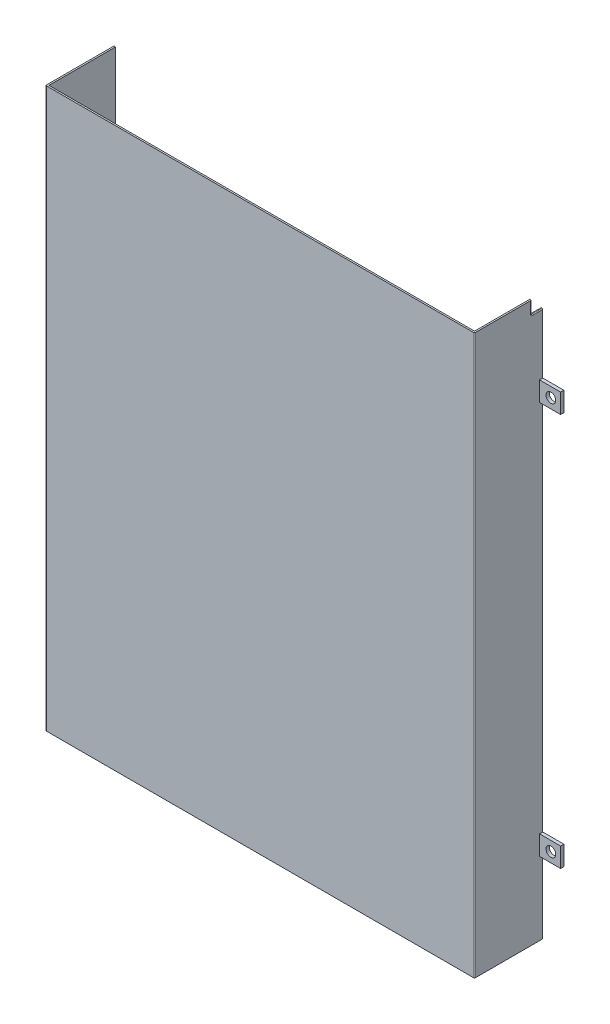
ISO-10303-21;
HEADER;
FILE_DESCRIPTION(('STEP AP214'),'2;1');
FILE_NAME('part.step','',(''),(''),'','','');
FILE_SCHEMA(('AUTOMOTIVE_DESIGN { 1 0 10303 214 1 1 1 1 }'));
ENDSEC;
DATA;
#1=APPLICATION_CONTEXT('core data for automotive mechanical design processes');
#2=APPLICATION_PROTOCOL_DEFINITION('international standard','automotive_design',2000,#1);
#3=PRODUCT_CONTEXT('',#1,'mechanical');
#4=PRODUCT('Part','Part','',(#3));
#5=PRODUCT_RELATED_PRODUCT_CATEGORY('part','',(#4));
#6=PRODUCT_DEFINITION_FORMATION('','',#4);
#7=PRODUCT_DEFINITION_CONTEXT('part definition',#1,'design');
#8=PRODUCT_DEFINITION('design','',#6,#7);
#9=PRODUCT_DEFINITION_SHAPE('','',#8);
#10=(LENGTH_UNIT() NAMED_UNIT(*) SI_UNIT(.MILLI.,.METRE.));
#11=(NAMED_UNIT(*) PLANE_ANGLE_UNIT() SI_UNIT($,.RADIAN.));
#12=(NAMED_UNIT(*) SI_UNIT($,.STERADIAN.) SOLID_ANGLE_UNIT());
#13=UNCERTAINTY_MEASURE_WITH_UNIT(LENGTH_MEASURE(1.E-05),#10,'distance_accuracy_value','');
#14=(GEOMETRIC_REPRESENTATION_CONTEXT(3) GLOBAL_UNCERTAINTY_ASSIGNED_CONTEXT((#13)) GLOBAL_UNIT_ASSIGNED_CONTEXT((#10,
#11,#12)) REPRESENTATION_CONTEXT('',''));
#15=CARTESIAN_POINT('',(0.,0.,0.));
#16=DIRECTION('',(0.,0.,1.));
#17=DIRECTION('',(1.,0.,0.));
#18=AXIS2_PLACEMENT_3D('',#15,#16,#17);
#19=CARTESIAN_POINT('',(212.,-172.,111.));
#20=DIRECTION('',(-1.,0.,0.));
#21=DIRECTION('',(0.,0.,1.));
#22=AXIS2_PLACEMENT_3D('',#19,#20,#21);
#23=PLANE('',#22);
#24=CARTESIAN_POINT('',(212.,164.5,117.5));
#25=DIRECTION('',(-1.,0.,0.));
#26=DIRECTION('',(0.,0.,1.));
#27=AXIS2_PLACEMENT_3D('',#24,#25,#26);
#28=CIRCLE('',#27,1.);
#29=CARTESIAN_POINT('',(212.,163.5,117.5));
#30=VERTEX_POINT('',#29);
#31=CARTESIAN_POINT('',(212.,164.5,118.5));
#32=VERTEX_POINT('',#31);
#33=EDGE_CURVE('E358',#30,#32,#28,.T.);
#34=ORIENTED_EDGE('',*,*,#33,.T.);
#35=DIRECTION('',(0.,1.,0.));
#36=VECTOR('',#35,1.);
#37=CARTESIAN_POINT('',(212.,172.,118.5));
#38=LINE('',#37,#36);
#39=CARTESIAN_POINT('',(212.,172.,118.5));
#40=VERTEX_POINT('',#39);
#41=EDGE_CURVE('E361',#32,#40,#38,.T.);
#42=ORIENTED_EDGE('',*,*,#41,.T.);
#43=DIRECTION('',(0.,0.,-1.));
#44=VECTOR('',#43,1.);
#45=CARTESIAN_POINT('',(212.,172.,111.));
#46=LINE('',#45,#44);
#47=CARTESIAN_POINT('',(212.,172.,152.5));
#48=VERTEX_POINT('',#47);
#49=EDGE_CURVE('E285',#40,#48,#46,.F.);
#50=ORIENTED_EDGE('',*,*,#49,.T.);
#51=DIRECTION('',(0.,1.,0.));
#52=VECTOR('',#51,1.);
#53=CARTESIAN_POINT('',(212.,-172.,152.5));
#54=LINE('',#53,#52);
#55=CARTESIAN_POINT('',(212.,-172.,152.5));
#56=VERTEX_POINT('',#55);
#57=EDGE_CURVE('E348',#48,#56,#54,.F.);
#58=ORIENTED_EDGE('',*,*,#57,.T.);
#59=DIRECTION('',(0.,0.,-1.));
#60=VECTOR('',#59,1.);
#61=CARTESIAN_POINT('',(212.,-172.,111.));
#62=LINE('',#61,#60);
#63=CARTESIAN_POINT('',(212.,-172.,111.));
#64=VERTEX_POINT('',#63);
#65=EDGE_CURVE('E302',#64,#56,#62,.F.);
#66=ORIENTED_EDGE('',*,*,#65,.F.);
#67=DIRECTION('',(0.,1.,0.));
#68=VECTOR('',#67,1.);
#69=CARTESIAN_POINT('',(212.,-172.,111.));
#70=LINE('',#69,#68);
#71=CARTESIAN_POINT('',(212.,-127.,111.));
#72=VERTEX_POINT('',#71);
#73=EDGE_CURVE('E323',#64,#72,#70,.T.);
#74=ORIENTED_EDGE('',*,*,#73,.T.);
#75=DIRECTION('',(0.,0.,-1.));
#76=VECTOR('',#75,1.);
#77=CARTESIAN_POINT('',(212.,-127.,113.));
#78=LINE('',#77,#76);
#79=CARTESIAN_POINT('',(212.,-127.,113.));
#80=VERTEX_POINT('',#79);
#81=EDGE_CURVE('E266',#80,#72,#78,.T.);
#82=ORIENTED_EDGE('',*,*,#81,.F.);
#83=DIRECTION('',(0.,1.,0.));
#84=VECTOR('',#83,1.);
#85=CARTESIAN_POINT('',(212.,-127.,113.));
#86=LINE('',#85,#84);
#87=CARTESIAN_POINT('',(212.,-115.,113.));
#88=VERTEX_POINT('',#87);
#89=EDGE_CURVE('E245',#80,#88,#86,.T.);
#90=ORIENTED_EDGE('',*,*,#89,.T.);
#91=DIRECTION('',(0.,0.,-1.));
#92=VECTOR('',#91,1.);
#93=CARTESIAN_POINT('',(212.,-115.,113.));
#94=LINE('',#93,#92);
#95=CARTESIAN_POINT('',(212.,-115.,111.));
#96=VERTEX_POINT('',#95);
#97=EDGE_CURVE('E258',#88,#96,#94,.T.);
#98=ORIENTED_EDGE('',*,*,#97,.T.);
#99=CARTESIAN_POINT('',(212.,115.,111.));
#100=VERTEX_POINT('',#99);
#101=EDGE_CURVE('E326',#96,#100,#70,.T.);
#102=ORIENTED_EDGE('',*,*,#101,.T.);
#103=DIRECTION('',(0.,0.,-1.));
#104=VECTOR('',#103,1.);
#105=CARTESIAN_POINT('',(212.,115.,113.));
#106=LINE('',#105,#104);
#107=CARTESIAN_POINT('',(212.,115.,113.));
#108=VERTEX_POINT('',#107);
#109=EDGE_CURVE('E233',#108,#100,#106,.T.);
#110=ORIENTED_EDGE('',*,*,#109,.F.);
#111=DIRECTION('',(0.,1.,0.));
#112=VECTOR('',#111,1.);
#113=CARTESIAN_POINT('',(212.,115.,113.));
#114=LINE('',#113,#112);
#115=CARTESIAN_POINT('',(212.,127.,113.));
#116=VERTEX_POINT('',#115);
#117=EDGE_CURVE('E220',#108,#116,#114,.T.);
#118=ORIENTED_EDGE('',*,*,#117,.T.);
#119=DIRECTION('',(0.,0.,-1.));
#120=VECTOR('',#119,1.);
#121=CARTESIAN_POINT('',(212.,127.,113.));
#122=LINE('',#121,#120);
#123=CARTESIAN_POINT('',(212.,127.,111.));
#124=VERTEX_POINT('',#123);
#125=EDGE_CURVE('E207',#116,#124,#122,.T.);
#126=ORIENTED_EDGE('',*,*,#125,.T.);
#127=CARTESIAN_POINT('',(212.,163.5,111.));
#128=VERTEX_POINT('',#127);
#129=EDGE_CURVE('E327',#124,#128,#70,.T.);
#130=ORIENTED_EDGE('',*,*,#129,.T.);
#131=DIRECTION('',(0.,0.,1.));
#132=VECTOR('',#131,1.);
#133=CARTESIAN_POINT('',(212.,163.5,117.5));
#134=LINE('',#133,#132);
#135=EDGE_CURVE('E356',#128,#30,#134,.T.);
#136=ORIENTED_EDGE('',*,*,#135,.T.);
#137=EDGE_LOOP('',(#34,#42,#50,#58,#66,#74,#82,#90,#98,#102,#110,#118,#126,#130,#136));
#138=FACE_BOUND('',#137,.T.);
#139=ADVANCED_FACE('F38',(#138),#23,.F.);
#140=CARTESIAN_POINT('',(211.,-172.,111.));
#141=DIRECTION('',(-1.,0.,0.));
#142=DIRECTION('',(0.,0.,1.));
#143=AXIS2_PLACEMENT_3D('',#140,#141,#142);
#144=PLANE('',#143);
#145=DIRECTION('',(0.,-1.,0.));
#146=VECTOR('',#145,1.);
#147=CARTESIAN_POINT('',(211.,-172.,118.));
#148=LINE('',#147,#146);
#149=CARTESIAN_POINT('',(211.,172.,118.));
#150=VERTEX_POINT('',#149);
#151=CARTESIAN_POINT('',(211.,164.5,118.));
#152=VERTEX_POINT('',#151);
#153=EDGE_CURVE('E380',#150,#152,#148,.T.);
#154=ORIENTED_EDGE('',*,*,#153,.T.);
#155=CARTESIAN_POINT('',(211.,164.5,117.5));
#156=DIRECTION('',(-1.,0.,0.));
#157=DIRECTION('',(0.,0.,1.));
#158=AXIS2_PLACEMENT_3D('',#155,#156,#157);
#159=CIRCLE('',#158,0.5);
#160=CARTESIAN_POINT('',(211.,164.,117.5));
#161=VERTEX_POINT('',#160);
#162=EDGE_CURVE('E354',#152,#161,#159,.F.);
#163=ORIENTED_EDGE('',*,*,#162,.T.);
#164=DIRECTION('',(0.,0.,-1.));
#165=VECTOR('',#164,1.);
#166=CARTESIAN_POINT('',(211.,164.,111.));
#167=LINE('',#166,#165);
#168=CARTESIAN_POINT('',(211.,164.,111.));
#169=VERTEX_POINT('',#168);
#170=EDGE_CURVE('E385',#161,#169,#167,.T.);
#171=ORIENTED_EDGE('',*,*,#170,.T.);
#172=DIRECTION('',(0.,1.,0.));
#173=VECTOR('',#172,1.);
#174=CARTESIAN_POINT('',(211.,-172.,111.));
#175=LINE('',#174,#173);
#176=CARTESIAN_POINT('',(211.,-172.,111.));
#177=VERTEX_POINT('',#176);
#178=EDGE_CURVE('E320',#177,#169,#175,.T.);
#179=ORIENTED_EDGE('',*,*,#178,.F.);
#180=DIRECTION('',(0.,0.,1.));
#181=VECTOR('',#180,1.);
#182=CARTESIAN_POINT('',(211.,-172.,111.));
#183=LINE('',#182,#181);
#184=CARTESIAN_POINT('',(211.,-172.,152.));
#185=VERTEX_POINT('',#184);
#186=EDGE_CURVE('E307',#177,#185,#183,.T.);
#187=ORIENTED_EDGE('',*,*,#186,.T.);
#188=DIRECTION('',(0.,1.,0.));
#189=VECTOR('',#188,1.);
#190=CARTESIAN_POINT('',(211.,-172.,152.));
#191=LINE('',#190,#189);
#192=CARTESIAN_POINT('',(211.,172.,152.));
#193=VERTEX_POINT('',#192);
#194=EDGE_CURVE('E317',#185,#193,#191,.T.);
#195=ORIENTED_EDGE('',*,*,#194,.T.);
#196=DIRECTION('',(0.,0.,1.));
#197=VECTOR('',#196,1.);
#198=CARTESIAN_POINT('',(211.,172.,111.));
#199=LINE('',#198,#197);
#200=EDGE_CURVE('E287',#150,#193,#199,.T.);
#201=ORIENTED_EDGE('',*,*,#200,.F.);
#202=EDGE_LOOP('',(#154,#163,#171,#179,#187,#195,#201));
#203=FACE_BOUND('',#202,.T.);
#204=ADVANCED_FACE('F399',(#203),#144,.T.);
#205=CARTESIAN_POINT('',(211.,-172.,111.));
#206=DIRECTION('',(0.,0.,1.));
#207=DIRECTION('',(1.,0.,0.));
#208=AXIS2_PLACEMENT_3D('',#205,#206,#207);
#209=PLANE('',#208);
#210=CARTESIAN_POINT('',(219.,121.,111.));
#211=DIRECTION('',(0.,0.,-1.));
#212=DIRECTION('',(-1.,0.,0.));
#213=AXIS2_PLACEMENT_3D('',#210,#211,#212);
#214=CIRCLE('',#213,2.99999999999999);
#215=CARTESIAN_POINT('',(216.,121.,111.));
#216=VERTEX_POINT('',#215);
#217=EDGE_CURVE('E388',#216,#216,#214,.T.);
#218=ORIENTED_EDGE('',*,*,#217,.F.);
#219=EDGE_LOOP('',(#218));
#220=FACE_BOUND('',#219,.T.);
#221=CARTESIAN_POINT('',(219.,-121.,111.));
#222=DIRECTION('',(0.,0.,-1.));
#223=DIRECTION('',(-1.,0.,0.));
#224=AXIS2_PLACEMENT_3D('',#221,#222,#223);
#225=CIRCLE('',#224,2.99999999999999);
#226=CARTESIAN_POINT('',(216.,-121.,111.));
#227=VERTEX_POINT('',#226);
#228=EDGE_CURVE('E236',#227,#227,#225,.T.);
#229=ORIENTED_EDGE('',*,*,#228,.F.);
#230=EDGE_LOOP('',(#229));
#231=FACE_BOUND('',#230,.T.);
#232=DIRECTION('',(-1.,0.,0.));
#233=VECTOR('',#232,1.);
#234=CARTESIAN_POINT('',(766.567680720757,164.,111.));
#235=LINE('',#234,#233);
#236=CARTESIAN_POINT('',(211.5,164.,111.));
#237=VERTEX_POINT('',#236);
#238=EDGE_CURVE('E377',#237,#169,#235,.T.);
#239=ORIENTED_EDGE('',*,*,#238,.F.);
#240=CARTESIAN_POINT('',(211.5,163.5,111.));
#241=DIRECTION('',(0.,0.,1.));
#242=DIRECTION('',(1.,0.,0.));
#243=AXIS2_PLACEMENT_3D('',#240,#241,#242);
#244=CIRCLE('',#243,0.5);
#245=EDGE_CURVE('E11',#237,#128,#244,.F.);
#246=ORIENTED_EDGE('',*,*,#245,.T.);
#247=ORIENTED_EDGE('',*,*,#129,.F.);
#248=DIRECTION('',(1.,0.,0.));
#249=VECTOR('',#248,1.);
#250=CARTESIAN_POINT('',(212.,127.,111.));
#251=LINE('',#250,#249);
#252=CARTESIAN_POINT('',(225.,127.,111.));
#253=VERTEX_POINT('',#252);
#254=EDGE_CURVE('E227',#124,#253,#251,.T.);
#255=ORIENTED_EDGE('',*,*,#254,.T.);
#256=DIRECTION('',(0.,-1.,0.));
#257=VECTOR('',#256,1.);
#258=CARTESIAN_POINT('',(225.,115.,111.));
#259=LINE('',#258,#257);
#260=CARTESIAN_POINT('',(225.,115.,111.));
#261=VERTEX_POINT('',#260);
#262=EDGE_CURVE('E201',#253,#261,#259,.T.);
#263=ORIENTED_EDGE('',*,*,#262,.T.);
#264=DIRECTION('',(-1.,0.,0.));
#265=VECTOR('',#264,1.);
#266=CARTESIAN_POINT('',(212.,115.,111.));
#267=LINE('',#266,#265);
#268=EDGE_CURVE('E222',#261,#100,#267,.T.);
#269=ORIENTED_EDGE('',*,*,#268,.T.);
#270=ORIENTED_EDGE('',*,*,#101,.F.);
#271=DIRECTION('',(1.,0.,0.));
#272=VECTOR('',#271,1.);
#273=CARTESIAN_POINT('',(212.,-115.,111.));
#274=LINE('',#273,#272);
#275=CARTESIAN_POINT('',(225.,-115.,111.));
#276=VERTEX_POINT('',#275);
#277=EDGE_CURVE('E242',#96,#276,#274,.T.);
#278=ORIENTED_EDGE('',*,*,#277,.T.);
#279=DIRECTION('',(0.,-1.,0.));
#280=VECTOR('',#279,1.);
#281=CARTESIAN_POINT('',(225.,-127.,111.));
#282=LINE('',#281,#280);
#283=CARTESIAN_POINT('',(225.,-127.,111.));
#284=VERTEX_POINT('',#283);
#285=EDGE_CURVE('E261',#276,#284,#282,.T.);
#286=ORIENTED_EDGE('',*,*,#285,.T.);
#287=DIRECTION('',(-1.,0.,0.));
#288=VECTOR('',#287,1.);
#289=CARTESIAN_POINT('',(212.,-127.,111.));
#290=LINE('',#289,#288);
#291=EDGE_CURVE('E249',#284,#72,#290,.T.);
#292=ORIENTED_EDGE('',*,*,#291,.T.);
#293=ORIENTED_EDGE('',*,*,#73,.F.);
#294=DIRECTION('',(1.,0.,0.));
#295=VECTOR('',#294,1.);
#296=CARTESIAN_POINT('',(211.,-172.,111.));
#297=LINE('',#296,#295);
#298=EDGE_CURVE('E305',#177,#64,#297,.T.);
#299=ORIENTED_EDGE('',*,*,#298,.F.);
#300=ORIENTED_EDGE('',*,*,#178,.T.);
#301=EDGE_LOOP('',(#239,#246,#247,#255,#263,#269,#270,#278,#286,#292,#293,#299,#300));
#302=FACE_BOUND('',#301,.T.);
#303=ADVANCED_FACE('F395',(#220,#231,#302),#209,.F.);
#304=CARTESIAN_POINT('',(0.,172.,0.));
#305=DIRECTION('',(0.,-1.,0.));
#306=DIRECTION('',(-1.,0.,0.));
#307=AXIS2_PLACEMENT_3D('',#304,#305,#306);
#308=PLANE('',#307);
#309=ORIENTED_EDGE('',*,*,#49,.F.);
#310=CARTESIAN_POINT('',(211.5,172.,118.5));
#311=DIRECTION('',(0.,-1.,0.));
#312=DIRECTION('',(0.,0.,-1.));
#313=AXIS2_PLACEMENT_3D('',#310,#311,#312);
#314=CIRCLE('',#313,0.5);
#315=CARTESIAN_POINT('',(211.5,172.,118.));
#316=VERTEX_POINT('',#315);
#317=EDGE_CURVE('E62',#40,#316,#314,.F.);
#318=ORIENTED_EDGE('',*,*,#317,.T.);
#319=DIRECTION('',(-1.,0.,0.));
#320=VECTOR('',#319,1.);
#321=CARTESIAN_POINT('',(766.567680720757,172.,118.));
#322=LINE('',#321,#320);
#323=EDGE_CURVE('E375',#316,#150,#322,.T.);
#324=ORIENTED_EDGE('',*,*,#323,.T.);
#325=ORIENTED_EDGE('',*,*,#200,.T.);
#326=DIRECTION('',(-1.,0.,0.));
#327=VECTOR('',#326,1.);
#328=CARTESIAN_POINT('',(211.,172.,152.));
#329=LINE('',#328,#327);
#330=CARTESIAN_POINT('',(-51.,172.,152.));
#331=VERTEX_POINT('',#330);
#332=EDGE_CURVE('E289',#193,#331,#329,.T.);
#333=ORIENTED_EDGE('',*,*,#332,.T.);
#334=DIRECTION('',(0.,0.,-1.));
#335=VECTOR('',#334,1.);
#336=CARTESIAN_POINT('',(-51.,172.,152.));
#337=LINE('',#336,#335);
#338=CARTESIAN_POINT('',(-51.,172.,111.));
#339=VERTEX_POINT('',#338);
#340=EDGE_CURVE('E268',#331,#339,#337,.T.);
#341=ORIENTED_EDGE('',*,*,#340,.T.);
#342=DIRECTION('',(1.,0.,0.));
#343=VECTOR('',#342,1.);
#344=CARTESIAN_POINT('',(-52.,172.,111.));
#345=LINE('',#344,#343);
#346=CARTESIAN_POINT('',(-52.,172.,111.));
#347=VERTEX_POINT('',#346);
#348=EDGE_CURVE('E277',#347,#339,#345,.T.);
#349=ORIENTED_EDGE('',*,*,#348,.F.);
#350=DIRECTION('',(0.,0.,-1.));
#351=VECTOR('',#350,1.);
#352=CARTESIAN_POINT('',(-52.,172.,152.));
#353=LINE('',#352,#351);
#354=CARTESIAN_POINT('',(-52.,172.,152.5));
#355=VERTEX_POINT('',#354);
#356=EDGE_CURVE('E280',#355,#347,#353,.T.);
#357=ORIENTED_EDGE('',*,*,#356,.F.);
#358=CARTESIAN_POINT('',(-51.5,172.,152.5));
#359=DIRECTION('',(0.,-1.,0.));
#360=DIRECTION('',(0.,0.,-1.));
#361=AXIS2_PLACEMENT_3D('',#358,#359,#360);
#362=CIRCLE('',#361,0.5);
#363=CARTESIAN_POINT('',(-51.5,172.,153.));
#364=VERTEX_POINT('',#363);
#365=EDGE_CURVE('E337',#355,#364,#362,.F.);
#366=ORIENTED_EDGE('',*,*,#365,.T.);
#367=DIRECTION('',(-1.,0.,0.));
#368=VECTOR('',#367,1.);
#369=CARTESIAN_POINT('',(211.,172.,153.));
#370=LINE('',#369,#368);
#371=CARTESIAN_POINT('',(211.5,172.,153.));
#372=VERTEX_POINT('',#371);
#373=EDGE_CURVE('E282',#372,#364,#370,.T.);
#374=ORIENTED_EDGE('',*,*,#373,.F.);
#375=CARTESIAN_POINT('',(211.5,172.,152.5));
#376=DIRECTION('',(0.,-1.,0.));
#377=DIRECTION('',(0.,0.,-1.));
#378=AXIS2_PLACEMENT_3D('',#375,#376,#377);
#379=CIRCLE('',#378,0.5);
#380=EDGE_CURVE('E334',#372,#48,#379,.F.);
#381=ORIENTED_EDGE('',*,*,#380,.T.);
#382=EDGE_LOOP('',(#309,#318,#324,#325,#333,#341,#349,#357,#366,#374,#381));
#383=FACE_BOUND('',#382,.T.);
#384=ADVANCED_FACE('F398',(#383),#308,.F.);
#385=CARTESIAN_POINT('',(-51.,-172.,152.));
#386=DIRECTION('',(1.,0.,0.));
#387=DIRECTION('',(0.,0.,-1.));
#388=AXIS2_PLACEMENT_3D('',#385,#386,#387);
#389=PLANE('',#388);
#390=DIRECTION('',(0.,1.,0.));
#391=VECTOR('',#390,1.);
#392=CARTESIAN_POINT('',(-51.,-172.,111.));
#393=LINE('',#392,#391);
#394=CARTESIAN_POINT('',(-51.,-172.,111.));
#395=VERTEX_POINT('',#394);
#396=EDGE_CURVE('E313',#395,#339,#393,.T.);
#397=ORIENTED_EDGE('',*,*,#396,.T.);
#398=ORIENTED_EDGE('',*,*,#340,.F.);
#399=DIRECTION('',(0.,1.,0.));
#400=VECTOR('',#399,1.);
#401=CARTESIAN_POINT('',(-51.,-172.,152.));
#402=LINE('',#401,#400);
#403=CARTESIAN_POINT('',(-51.,-172.,152.));
#404=VERTEX_POINT('',#403);
#405=EDGE_CURVE('E314',#404,#331,#402,.T.);
#406=ORIENTED_EDGE('',*,*,#405,.F.);
#407=DIRECTION('',(0.,0.,-1.));
#408=VECTOR('',#407,1.);
#409=CARTESIAN_POINT('',(-51.,-172.,152.));
#410=LINE('',#409,#408);
#411=EDGE_CURVE('E292',#404,#395,#410,.T.);
#412=ORIENTED_EDGE('',*,*,#411,.T.);
#413=EDGE_LOOP('',(#397,#398,#406,#412));
#414=FACE_BOUND('',#413,.T.);
#415=ADVANCED_FACE('F448',(#414),#389,.T.);
#416=CARTESIAN_POINT('',(211.,-172.,152.));
#417=DIRECTION('',(0.,0.,-1.));
#418=DIRECTION('',(-1.,0.,0.));
#419=AXIS2_PLACEMENT_3D('',#416,#417,#418);
#420=PLANE('',#419);
#421=ORIENTED_EDGE('',*,*,#405,.T.);
#422=ORIENTED_EDGE('',*,*,#332,.F.);
#423=ORIENTED_EDGE('',*,*,#194,.F.);
#424=DIRECTION('',(-1.,0.,0.));
#425=VECTOR('',#424,1.);
#426=CARTESIAN_POINT('',(211.,-172.,152.));
#427=LINE('',#426,#425);
#428=EDGE_CURVE('E310',#185,#404,#427,.T.);
#429=ORIENTED_EDGE('',*,*,#428,.T.);
#430=EDGE_LOOP('',(#421,#422,#423,#429));
#431=FACE_BOUND('',#430,.T.);
#432=ADVANCED_FACE('F438',(#431),#420,.T.);
#433=CARTESIAN_POINT('',(211.,-172.,153.));
#434=DIRECTION('',(0.,0.,-1.));
#435=DIRECTION('',(-1.,0.,0.));
#436=AXIS2_PLACEMENT_3D('',#433,#434,#435);
#437=PLANE('',#436);
#438=ORIENTED_EDGE('',*,*,#373,.T.);
#439=DIRECTION('',(0.,1.,0.));
#440=VECTOR('',#439,1.);
#441=CARTESIAN_POINT('',(-51.5,-172.,153.));
#442=LINE('',#441,#440);
#443=CARTESIAN_POINT('',(-51.5,-172.,153.));
#444=VERTEX_POINT('',#443);
#445=EDGE_CURVE('E342',#364,#444,#442,.F.);
#446=ORIENTED_EDGE('',*,*,#445,.T.);
#447=DIRECTION('',(-1.,0.,0.));
#448=VECTOR('',#447,1.);
#449=CARTESIAN_POINT('',(211.,-172.,153.));
#450=LINE('',#449,#448);
#451=CARTESIAN_POINT('',(211.5,-172.,153.));
#452=VERTEX_POINT('',#451);
#453=EDGE_CURVE('E299',#452,#444,#450,.T.);
#454=ORIENTED_EDGE('',*,*,#453,.F.);
#455=DIRECTION('',(0.,1.,0.));
#456=VECTOR('',#455,1.);
#457=CARTESIAN_POINT('',(211.5,-172.,153.));
#458=LINE('',#457,#456);
#459=EDGE_CURVE('E339',#452,#372,#458,.T.);
#460=ORIENTED_EDGE('',*,*,#459,.T.);
#461=EDGE_LOOP('',(#438,#446,#454,#460));
#462=FACE_BOUND('',#461,.T.);
#463=ADVANCED_FACE('F434',(#462),#437,.F.);
#464=CARTESIAN_POINT('',(-52.,-172.,152.));
#465=DIRECTION('',(1.,0.,0.));
#466=DIRECTION('',(0.,0.,-1.));
#467=AXIS2_PLACEMENT_3D('',#464,#465,#466);
#468=PLANE('',#467);
#469=DIRECTION('',(0.,0.,-1.));
#470=VECTOR('',#469,1.);
#471=CARTESIAN_POINT('',(-52.,-172.,152.));
#472=LINE('',#471,#470);
#473=CARTESIAN_POINT('',(-52.,-172.,152.5));
#474=VERTEX_POINT('',#473);
#475=CARTESIAN_POINT('',(-52.,-172.,111.));
#476=VERTEX_POINT('',#475);
#477=EDGE_CURVE('E297',#474,#476,#472,.T.);
#478=ORIENTED_EDGE('',*,*,#477,.F.);
#479=DIRECTION('',(0.,1.,0.));
#480=VECTOR('',#479,1.);
#481=CARTESIAN_POINT('',(-52.,-172.,152.5));
#482=LINE('',#481,#480);
#483=EDGE_CURVE('E316',#474,#355,#482,.T.);
#484=ORIENTED_EDGE('',*,*,#483,.T.);
#485=ORIENTED_EDGE('',*,*,#356,.T.);
#486=DIRECTION('',(0.,1.,0.));
#487=VECTOR('',#486,1.);
#488=CARTESIAN_POINT('',(-52.,-172.,111.));
#489=LINE('',#488,#487);
#490=EDGE_CURVE('E328',#476,#347,#489,.T.);
#491=ORIENTED_EDGE('',*,*,#490,.F.);
#492=EDGE_LOOP('',(#478,#484,#485,#491));
#493=FACE_BOUND('',#492,.T.);
#494=ADVANCED_FACE('F437',(#493),#468,.F.);
#495=CARTESIAN_POINT('',(-52.,-172.,111.));
#496=DIRECTION('',(0.,0.,1.));
#497=DIRECTION('',(1.,0.,0.));
#498=AXIS2_PLACEMENT_3D('',#495,#496,#497);
#499=PLANE('',#498);
#500=ORIENTED_EDGE('',*,*,#490,.T.);
#501=ORIENTED_EDGE('',*,*,#348,.T.);
#502=ORIENTED_EDGE('',*,*,#396,.F.);
#503=DIRECTION('',(1.,0.,0.));
#504=VECTOR('',#503,1.);
#505=CARTESIAN_POINT('',(-52.,-172.,111.));
#506=LINE('',#505,#504);
#507=EDGE_CURVE('E295',#476,#395,#506,.T.);
#508=ORIENTED_EDGE('',*,*,#507,.F.);
#509=EDGE_LOOP('',(#500,#501,#502,#508));
#510=FACE_BOUND('',#509,.T.);
#511=ADVANCED_FACE('F442',(#510),#499,.F.);
#512=CARTESIAN_POINT('',(0.,-172.,0.));
#513=DIRECTION('',(0.,-1.,0.));
#514=DIRECTION('',(-1.,0.,0.));
#515=AXIS2_PLACEMENT_3D('',#512,#513,#514);
#516=PLANE('',#515);
#517=ORIENTED_EDGE('',*,*,#453,.T.);
#518=CARTESIAN_POINT('',(-51.5,-172.,152.5));
#519=DIRECTION('',(0.,-1.,0.));
#520=DIRECTION('',(0.,0.,-1.));
#521=AXIS2_PLACEMENT_3D('',#518,#519,#520);
#522=CIRCLE('',#521,0.5);
#523=EDGE_CURVE('E346',#444,#474,#522,.T.);
#524=ORIENTED_EDGE('',*,*,#523,.T.);
#525=ORIENTED_EDGE('',*,*,#477,.T.);
#526=ORIENTED_EDGE('',*,*,#507,.T.);
#527=ORIENTED_EDGE('',*,*,#411,.F.);
#528=ORIENTED_EDGE('',*,*,#428,.F.);
#529=ORIENTED_EDGE('',*,*,#186,.F.);
#530=ORIENTED_EDGE('',*,*,#298,.T.);
#531=ORIENTED_EDGE('',*,*,#65,.T.);
#532=CARTESIAN_POINT('',(211.5,-172.,152.5));
#533=DIRECTION('',(0.,-1.,0.));
#534=DIRECTION('',(0.,0.,-1.));
#535=AXIS2_PLACEMENT_3D('',#532,#533,#534);
#536=CIRCLE('',#535,0.5);
#537=EDGE_CURVE('E344',#56,#452,#536,.T.);
#538=ORIENTED_EDGE('',*,*,#537,.T.);
#539=EDGE_LOOP('',(#517,#524,#525,#526,#527,#528,#529,#530,#531,#538));
#540=FACE_BOUND('',#539,.T.);
#541=ADVANCED_FACE('F446',(#540),#516,.T.);
#542=CARTESIAN_POINT('',(212.,-127.,113.));
#543=DIRECTION('',(0.,-1.,0.));
#544=DIRECTION('',(1.,0.,0.));
#545=AXIS2_PLACEMENT_3D('',#542,#543,#544);
#546=PLANE('',#545);
#547=ORIENTED_EDGE('',*,*,#291,.F.);
#548=DIRECTION('',(0.,0.,-1.));
#549=VECTOR('',#548,1.);
#550=CARTESIAN_POINT('',(225.,-127.,113.));
#551=LINE('',#550,#549);
#552=CARTESIAN_POINT('',(225.,-127.,113.));
#553=VERTEX_POINT('',#552);
#554=EDGE_CURVE('E269',#553,#284,#551,.T.);
#555=ORIENTED_EDGE('',*,*,#554,.F.);
#556=DIRECTION('',(-1.,0.,0.));
#557=VECTOR('',#556,1.);
#558=CARTESIAN_POINT('',(212.,-127.,113.));
#559=LINE('',#558,#557);
#560=EDGE_CURVE('E255',#553,#80,#559,.T.);
#561=ORIENTED_EDGE('',*,*,#560,.T.);
#562=ORIENTED_EDGE('',*,*,#81,.T.);
#563=EDGE_LOOP('',(#547,#555,#561,#562));
#564=FACE_BOUND('',#563,.T.);
#565=ADVANCED_FACE('F506',(#564),#546,.T.);
#566=CARTESIAN_POINT('',(225.,-127.,113.));
#567=DIRECTION('',(1.,0.,0.));
#568=DIRECTION('',(0.,0.,-1.));
#569=AXIS2_PLACEMENT_3D('',#566,#567,#568);
#570=PLANE('',#569);
#571=ORIENTED_EDGE('',*,*,#285,.F.);
#572=DIRECTION('',(0.,0.,-1.));
#573=VECTOR('',#572,1.);
#574=CARTESIAN_POINT('',(225.,-115.,113.));
#575=LINE('',#574,#573);
#576=CARTESIAN_POINT('',(225.,-115.,113.));
#577=VERTEX_POINT('',#576);
#578=EDGE_CURVE('E271',#577,#276,#575,.T.);
#579=ORIENTED_EDGE('',*,*,#578,.F.);
#580=DIRECTION('',(0.,-1.,0.));
#581=VECTOR('',#580,1.);
#582=CARTESIAN_POINT('',(225.,-127.,113.));
#583=LINE('',#582,#581);
#584=EDGE_CURVE('E252',#577,#553,#583,.T.);
#585=ORIENTED_EDGE('',*,*,#584,.T.);
#586=ORIENTED_EDGE('',*,*,#554,.T.);
#587=EDGE_LOOP('',(#571,#579,#585,#586));
#588=FACE_BOUND('',#587,.T.);
#589=ADVANCED_FACE('F514',(#588),#570,.T.);
#590=CARTESIAN_POINT('',(212.,-115.,113.));
#591=DIRECTION('',(0.,1.,0.));
#592=DIRECTION('',(0.,0.,1.));
#593=AXIS2_PLACEMENT_3D('',#590,#591,#592);
#594=PLANE('',#593);
#595=ORIENTED_EDGE('',*,*,#277,.F.);
#596=ORIENTED_EDGE('',*,*,#97,.F.);
#597=DIRECTION('',(1.,0.,0.));
#598=VECTOR('',#597,1.);
#599=CARTESIAN_POINT('',(212.,-115.,113.));
#600=LINE('',#599,#598);
#601=EDGE_CURVE('E248',#88,#577,#600,.T.);
#602=ORIENTED_EDGE('',*,*,#601,.T.);
#603=ORIENTED_EDGE('',*,*,#578,.T.);
#604=EDGE_LOOP('',(#595,#596,#602,#603));
#605=FACE_BOUND('',#604,.T.);
#606=ADVANCED_FACE('F512',(#605),#594,.T.);
#607=CARTESIAN_POINT('',(0.,0.,113.));
#608=DIRECTION('',(0.,0.,-1.));
#609=DIRECTION('',(-1.,0.,0.));
#610=AXIS2_PLACEMENT_3D('',#607,#608,#609);
#611=PLANE('',#610);
#612=CARTESIAN_POINT('',(219.,-121.,113.));
#613=DIRECTION('',(0.,0.,-1.));
#614=DIRECTION('',(-1.,0.,0.));
#615=AXIS2_PLACEMENT_3D('',#612,#613,#614);
#616=CIRCLE('',#615,2.99999999999999);
#617=CARTESIAN_POINT('',(216.,-121.,113.));
#618=VERTEX_POINT('',#617);
#619=EDGE_CURVE('E239',#618,#618,#616,.T.);
#620=ORIENTED_EDGE('',*,*,#619,.T.);
#621=EDGE_LOOP('',(#620));
#622=FACE_BOUND('',#621,.T.);
#623=ORIENTED_EDGE('',*,*,#89,.F.);
#624=ORIENTED_EDGE('',*,*,#560,.F.);
#625=ORIENTED_EDGE('',*,*,#584,.F.);
#626=ORIENTED_EDGE('',*,*,#601,.F.);
#627=EDGE_LOOP('',(#623,#624,#625,#626));
#628=FACE_BOUND('',#627,.T.);
#629=ADVANCED_FACE('F422',(#622,#628),#611,.F.);
#630=CARTESIAN_POINT('',(219.,-121.,113.));
#631=DIRECTION('',(0.,0.,-1.));
#632=DIRECTION('',(-1.,0.,0.));
#633=AXIS2_PLACEMENT_3D('',#630,#631,#632);
#634=CYLINDRICAL_SURFACE('',#633,2.99999999999999);
#635=ORIENTED_EDGE('',*,*,#619,.F.);
#636=EDGE_LOOP('',(#635));
#637=FACE_BOUND('',#636,.T.);
#638=ORIENTED_EDGE('',*,*,#228,.T.);
#639=EDGE_LOOP('',(#638));
#640=FACE_BOUND('',#639,.T.);
#641=ADVANCED_FACE('F415',(#637,#640),#634,.F.);
#642=CARTESIAN_POINT('',(212.,115.,113.));
#643=DIRECTION('',(0.,-1.,0.));
#644=DIRECTION('',(1.,0.,0.));
#645=AXIS2_PLACEMENT_3D('',#642,#643,#644);
#646=PLANE('',#645);
#647=ORIENTED_EDGE('',*,*,#268,.F.);
#648=DIRECTION('',(0.,0.,-1.));
#649=VECTOR('',#648,1.);
#650=CARTESIAN_POINT('',(225.,115.,113.));
#651=LINE('',#650,#649);
#652=CARTESIAN_POINT('',(225.,115.,113.));
#653=VERTEX_POINT('',#652);
#654=EDGE_CURVE('E206',#653,#261,#651,.T.);
#655=ORIENTED_EDGE('',*,*,#654,.F.);
#656=DIRECTION('',(-1.,0.,0.));
#657=VECTOR('',#656,1.);
#658=CARTESIAN_POINT('',(212.,115.,113.));
#659=LINE('',#658,#657);
#660=EDGE_CURVE('E215',#653,#108,#659,.T.);
#661=ORIENTED_EDGE('',*,*,#660,.T.);
#662=ORIENTED_EDGE('',*,*,#109,.T.);
#663=EDGE_LOOP('',(#647,#655,#661,#662));
#664=FACE_BOUND('',#663,.T.);
#665=ADVANCED_FACE('F413',(#664),#646,.T.);
#666=CARTESIAN_POINT('',(225.,115.,113.));
#667=DIRECTION('',(1.,0.,0.));
#668=DIRECTION('',(0.,0.,-1.));
#669=AXIS2_PLACEMENT_3D('',#666,#667,#668);
#670=PLANE('',#669);
#671=ORIENTED_EDGE('',*,*,#262,.F.);
#672=DIRECTION('',(0.,0.,-1.));
#673=VECTOR('',#672,1.);
#674=CARTESIAN_POINT('',(225.,127.,113.));
#675=LINE('',#674,#673);
#676=CARTESIAN_POINT('',(225.,127.,113.));
#677=VERTEX_POINT('',#676);
#678=EDGE_CURVE('E195',#677,#253,#675,.T.);
#679=ORIENTED_EDGE('',*,*,#678,.F.);
#680=DIRECTION('',(0.,-1.,0.));
#681=VECTOR('',#680,1.);
#682=CARTESIAN_POINT('',(225.,115.,113.));
#683=LINE('',#682,#681);
#684=EDGE_CURVE('E198',#677,#653,#683,.T.);
#685=ORIENTED_EDGE('',*,*,#684,.T.);
#686=ORIENTED_EDGE('',*,*,#654,.T.);
#687=EDGE_LOOP('',(#671,#679,#685,#686));
#688=FACE_BOUND('',#687,.T.);
#689=ADVANCED_FACE('F197',(#688),#670,.T.);
#690=CARTESIAN_POINT('',(212.,127.,113.));
#691=DIRECTION('',(0.,1.,0.));
#692=DIRECTION('',(0.,0.,1.));
#693=AXIS2_PLACEMENT_3D('',#690,#691,#692);
#694=PLANE('',#693);
#695=ORIENTED_EDGE('',*,*,#254,.F.);
#696=ORIENTED_EDGE('',*,*,#125,.F.);
#697=DIRECTION('',(1.,0.,0.));
#698=VECTOR('',#697,1.);
#699=CARTESIAN_POINT('',(212.,127.,113.));
#700=LINE('',#699,#698);
#701=EDGE_CURVE('E213',#116,#677,#700,.T.);
#702=ORIENTED_EDGE('',*,*,#701,.T.);
#703=ORIENTED_EDGE('',*,*,#678,.T.);
#704=EDGE_LOOP('',(#695,#696,#702,#703));
#705=FACE_BOUND('',#704,.T.);
#706=ADVANCED_FACE('F218',(#705),#694,.T.);
#707=CARTESIAN_POINT('',(0.,0.,113.));
#708=DIRECTION('',(0.,0.,-1.));
#709=DIRECTION('',(-1.,0.,0.));
#710=AXIS2_PLACEMENT_3D('',#707,#708,#709);
#711=PLANE('',#710);
#712=CARTESIAN_POINT('',(219.,121.,113.));
#713=DIRECTION('',(0.,0.,-1.));
#714=DIRECTION('',(-1.,0.,0.));
#715=AXIS2_PLACEMENT_3D('',#712,#713,#714);
#716=CIRCLE('',#715,2.99999999999999);
#717=CARTESIAN_POINT('',(216.,121.,113.));
#718=VERTEX_POINT('',#717);
#719=EDGE_CURVE('E229',#718,#718,#716,.T.);
#720=ORIENTED_EDGE('',*,*,#719,.T.);
#721=EDGE_LOOP('',(#720));
#722=FACE_BOUND('',#721,.T.);
#723=ORIENTED_EDGE('',*,*,#117,.F.);
#724=ORIENTED_EDGE('',*,*,#660,.F.);
#725=ORIENTED_EDGE('',*,*,#684,.F.);
#726=ORIENTED_EDGE('',*,*,#701,.F.);
#727=EDGE_LOOP('',(#723,#724,#725,#726));
#728=FACE_BOUND('',#727,.T.);
#729=ADVANCED_FACE('F212',(#722,#728),#711,.F.);
#730=CARTESIAN_POINT('',(219.,121.,113.));
#731=DIRECTION('',(0.,0.,-1.));
#732=DIRECTION('',(-1.,0.,0.));
#733=AXIS2_PLACEMENT_3D('',#730,#731,#732);
#734=CYLINDRICAL_SURFACE('',#733,2.99999999999999);
#735=ORIENTED_EDGE('',*,*,#719,.F.);
#736=EDGE_LOOP('',(#735));
#737=FACE_BOUND('',#736,.T.);
#738=ORIENTED_EDGE('',*,*,#217,.T.);
#739=EDGE_LOOP('',(#738));
#740=FACE_BOUND('',#739,.T.);
#741=ADVANCED_FACE('F393',(#737,#740),#734,.F.);
#742=CARTESIAN_POINT('',(-51.5,-172.,152.5));
#743=DIRECTION('',(0.,1.,0.));
#744=DIRECTION('',(0.,0.,1.));
#745=AXIS2_PLACEMENT_3D('',#742,#743,#744);
#746=CYLINDRICAL_SURFACE('',#745,0.5);
#747=ORIENTED_EDGE('',*,*,#523,.F.);
#748=ORIENTED_EDGE('',*,*,#445,.F.);
#749=ORIENTED_EDGE('',*,*,#365,.F.);
#750=ORIENTED_EDGE('',*,*,#483,.F.);
#751=EDGE_LOOP('',(#747,#748,#749,#750));
#752=FACE_BOUND('',#751,.T.);
#753=ADVANCED_FACE('F452',(#752),#746,.T.);
#754=CARTESIAN_POINT('',(211.5,-172.,152.5));
#755=DIRECTION('',(0.,1.,0.));
#756=DIRECTION('',(0.,0.,1.));
#757=AXIS2_PLACEMENT_3D('',#754,#755,#756);
#758=CYLINDRICAL_SURFACE('',#757,0.5);
#759=ORIENTED_EDGE('',*,*,#537,.F.);
#760=ORIENTED_EDGE('',*,*,#57,.F.);
#761=ORIENTED_EDGE('',*,*,#380,.F.);
#762=ORIENTED_EDGE('',*,*,#459,.F.);
#763=EDGE_LOOP('',(#759,#760,#761,#762));
#764=FACE_BOUND('',#763,.T.);
#765=ADVANCED_FACE('F455',(#764),#758,.T.);
#766=CARTESIAN_POINT('',(766.567680720757,164.,118.));
#767=DIRECTION('',(0.,1.,0.));
#768=DIRECTION('',(0.,0.,1.));
#769=AXIS2_PLACEMENT_3D('',#766,#767,#768);
#770=PLANE('',#769);
#771=DIRECTION('',(-1.,0.,0.));
#772=VECTOR('',#771,1.);
#773=CARTESIAN_POINT('',(212.,164.,117.5));
#774=LINE('',#773,#772);
#775=CARTESIAN_POINT('',(211.5,164.,117.5));
#776=VERTEX_POINT('',#775);
#777=EDGE_CURVE('E352',#161,#776,#774,.F.);
#778=ORIENTED_EDGE('',*,*,#777,.T.);
#779=DIRECTION('',(0.,0.,1.));
#780=VECTOR('',#779,1.);
#781=CARTESIAN_POINT('',(211.5,164.,111.));
#782=LINE('',#781,#780);
#783=EDGE_CURVE('E47',#776,#237,#782,.F.);
#784=ORIENTED_EDGE('',*,*,#783,.T.);
#785=ORIENTED_EDGE('',*,*,#238,.T.);
#786=ORIENTED_EDGE('',*,*,#170,.F.);
#787=EDGE_LOOP('',(#778,#784,#785,#786));
#788=FACE_BOUND('',#787,.T.);
#789=ADVANCED_FACE('F459',(#788),#770,.T.);
#790=CARTESIAN_POINT('',(766.567680720757,172.,118.));
#791=DIRECTION('',(0.,0.,-1.));
#792=DIRECTION('',(-1.,0.,0.));
#793=AXIS2_PLACEMENT_3D('',#790,#791,#792);
#794=PLANE('',#793);
#795=ORIENTED_EDGE('',*,*,#323,.F.);
#796=DIRECTION('',(0.,1.,0.));
#797=VECTOR('',#796,1.);
#798=CARTESIAN_POINT('',(211.5,164.5,118.));
#799=LINE('',#798,#797);
#800=CARTESIAN_POINT('',(211.5,164.5,118.));
#801=VERTEX_POINT('',#800);
#802=EDGE_CURVE('E366',#316,#801,#799,.F.);
#803=ORIENTED_EDGE('',*,*,#802,.T.);
#804=DIRECTION('',(-1.,0.,0.));
#805=VECTOR('',#804,1.);
#806=CARTESIAN_POINT('',(211.,164.5,118.));
#807=LINE('',#806,#805);
#808=EDGE_CURVE('E350',#801,#152,#807,.T.);
#809=ORIENTED_EDGE('',*,*,#808,.T.);
#810=ORIENTED_EDGE('',*,*,#153,.F.);
#811=EDGE_LOOP('',(#795,#803,#809,#810));
#812=FACE_BOUND('',#811,.T.);
#813=ADVANCED_FACE('F464',(#812),#794,.T.);
#814=CARTESIAN_POINT('',(766.567680720757,164.5,117.5));
#815=DIRECTION('',(1.,0.,0.));
#816=DIRECTION('',(0.,0.,-1.));
#817=AXIS2_PLACEMENT_3D('',#814,#815,#816);
#818=CYLINDRICAL_SURFACE('',#817,0.5);
#819=ORIENTED_EDGE('',*,*,#808,.F.);
#820=CARTESIAN_POINT('',(211.5,164.5,117.5));
#821=DIRECTION('',(-1.,0.,0.));
#822=DIRECTION('',(0.,0.,1.));
#823=AXIS2_PLACEMENT_3D('',#820,#821,#822);
#824=CIRCLE('',#823,0.5);
#825=EDGE_CURVE('E363',#801,#776,#824,.F.);
#826=ORIENTED_EDGE('',*,*,#825,.T.);
#827=ORIENTED_EDGE('',*,*,#777,.F.);
#828=ORIENTED_EDGE('',*,*,#162,.F.);
#829=EDGE_LOOP('',(#819,#826,#827,#828));
#830=FACE_BOUND('',#829,.T.);
#831=ADVANCED_FACE('F461',(#830),#818,.F.);
#832=CARTESIAN_POINT('',(211.5,163.5,111.));
#833=DIRECTION('',(0.,0.,-1.));
#834=DIRECTION('',(-1.,0.,0.));
#835=AXIS2_PLACEMENT_3D('',#832,#833,#834);
#836=CYLINDRICAL_SURFACE('',#835,0.5);
#837=ORIENTED_EDGE('',*,*,#245,.F.);
#838=ORIENTED_EDGE('',*,*,#783,.F.);
#839=CARTESIAN_POINT('',(211.5,163.5,117.5));
#840=DIRECTION('',(0.,0.,1.));
#841=DIRECTION('',(1.,0.,0.));
#842=AXIS2_PLACEMENT_3D('',#839,#840,#841);
#843=CIRCLE('',#842,0.5);
#844=EDGE_CURVE('E42',#30,#776,#843,.T.);
#845=ORIENTED_EDGE('',*,*,#844,.F.);
#846=ORIENTED_EDGE('',*,*,#135,.F.);
#847=EDGE_LOOP('',(#837,#838,#845,#846));
#848=FACE_BOUND('',#847,.T.);
#849=ADVANCED_FACE('F40',(#848),#836,.T.);
#850=CARTESIAN_POINT('',(211.5,-172.,118.5));
#851=DIRECTION('',(0.,-1.,0.));
#852=DIRECTION('',(0.,0.,-1.));
#853=AXIS2_PLACEMENT_3D('',#850,#851,#852);
#854=CYLINDRICAL_SURFACE('',#853,0.5);
#855=ORIENTED_EDGE('',*,*,#317,.F.);
#856=ORIENTED_EDGE('',*,*,#41,.F.);
#857=CARTESIAN_POINT('',(211.5,164.5,118.5));
#858=DIRECTION('',(0.,-1.,0.));
#859=DIRECTION('',(0.,0.,-1.));
#860=AXIS2_PLACEMENT_3D('',#857,#858,#859);
#861=CIRCLE('',#860,0.5);
#862=EDGE_CURVE('E368',#801,#32,#861,.T.);
#863=ORIENTED_EDGE('',*,*,#862,.F.);
#864=ORIENTED_EDGE('',*,*,#802,.F.);
#865=EDGE_LOOP('',(#855,#856,#863,#864));
#866=FACE_BOUND('',#865,.T.);
#867=ADVANCED_FACE('F468',(#866),#854,.T.);
#868=CARTESIAN_POINT('',(211.5,164.5,117.5));
#869=DIRECTION('',(-1.,0.,0.));
#870=DIRECTION('',(0.,0.,1.));
#871=AXIS2_PLACEMENT_3D('',#868,#869,#870);
#872=TOROIDAL_SURFACE('',#871,1.,0.5);
#873=ORIENTED_EDGE('',*,*,#844,.T.);
#874=ORIENTED_EDGE('',*,*,#825,.F.);
#875=ORIENTED_EDGE('',*,*,#862,.T.);
#876=ORIENTED_EDGE('',*,*,#33,.F.);
#877=EDGE_LOOP('',(#873,#874,#875,#876));
#878=FACE_BOUND('',#877,.T.);
#879=ADVANCED_FACE('F466',(#878),#872,.T.);
#880=CLOSED_SHELL('',(#139,#204,#303,#384,#415,#432,#463,#494,#511,#541,#565,#589,#606,#629,
#641,#665,#689,#706,#729,#741,#753,#765,#789,#813,#831,#849,#867,#879));
#881=MANIFOLD_SOLID_BREP('B2',#880);
#882=ADVANCED_BREP_SHAPE_REPRESENTATION('',(#18,#881),#14);
#883=SHAPE_DEFINITION_REPRESENTATION(#9,#882);
ENDSEC;
END-ISO-10303-21;
